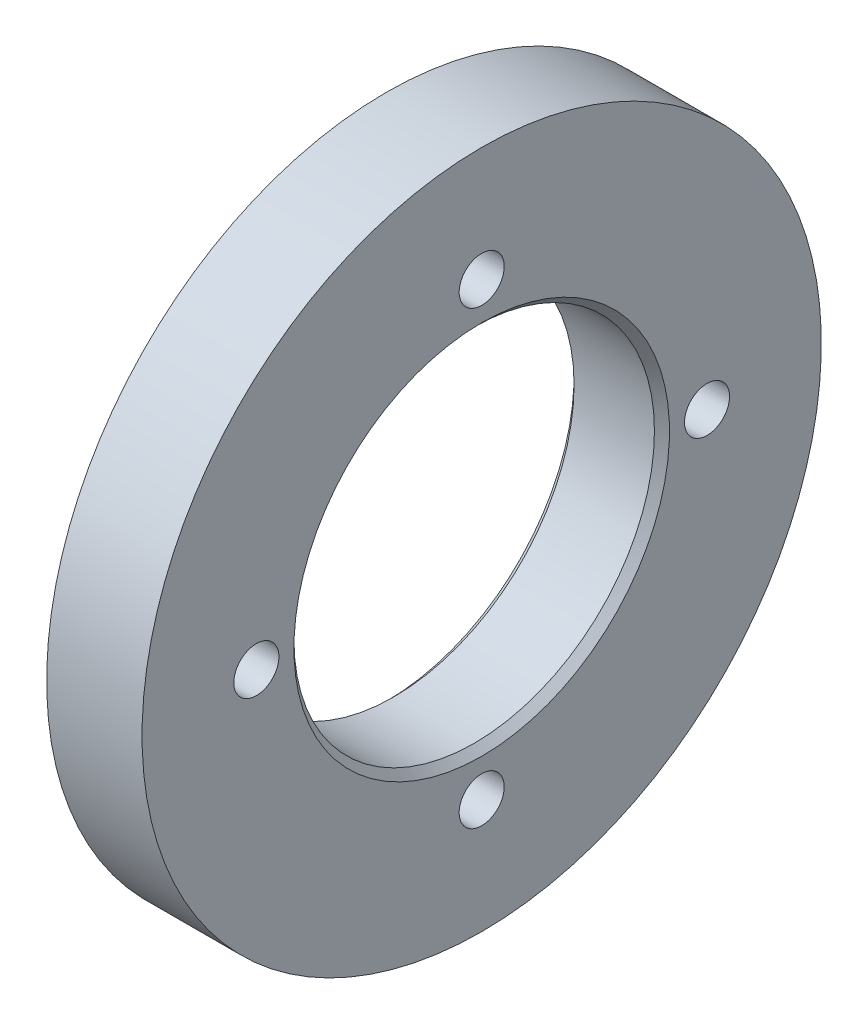
ISO-10303-21;
HEADER;
FILE_DESCRIPTION(('STEP AP214'),'2;1');
FILE_NAME('part.step','',(''),(''),'','','');
FILE_SCHEMA(('AUTOMOTIVE_DESIGN { 1 0 10303 214 1 1 1 1 }'));
ENDSEC;
DATA;
#1=APPLICATION_CONTEXT('core data for automotive mechanical design processes');
#2=APPLICATION_PROTOCOL_DEFINITION('international standard','automotive_design',2000,#1);
#3=PRODUCT_CONTEXT('',#1,'mechanical');
#4=PRODUCT('Part','Part','',(#3));
#5=PRODUCT_RELATED_PRODUCT_CATEGORY('part','',(#4));
#6=PRODUCT_DEFINITION_FORMATION('','',#4);
#7=PRODUCT_DEFINITION_CONTEXT('part definition',#1,'design');
#8=PRODUCT_DEFINITION('design','',#6,#7);
#9=PRODUCT_DEFINITION_SHAPE('','',#8);
#10=(LENGTH_UNIT() NAMED_UNIT(*) SI_UNIT(.MILLI.,.METRE.));
#11=(NAMED_UNIT(*) PLANE_ANGLE_UNIT() SI_UNIT($,.RADIAN.));
#12=(NAMED_UNIT(*) SI_UNIT($,.STERADIAN.) SOLID_ANGLE_UNIT());
#13=UNCERTAINTY_MEASURE_WITH_UNIT(LENGTH_MEASURE(1.E-05),#10,'distance_accuracy_value','');
#14=(GEOMETRIC_REPRESENTATION_CONTEXT(3) GLOBAL_UNCERTAINTY_ASSIGNED_CONTEXT((#13)) GLOBAL_UNIT_ASSIGNED_CONTEXT((#10,
#11,#12)) REPRESENTATION_CONTEXT('',''));
#15=CARTESIAN_POINT('',(0.,0.,0.));
#16=DIRECTION('',(0.,0.,1.));
#17=DIRECTION('',(1.,0.,0.));
#18=AXIS2_PLACEMENT_3D('',#15,#16,#17);
#19=CARTESIAN_POINT('',(6.34999999999764,0.,0.));
#20=DIRECTION('',(1.,0.,0.));
#21=DIRECTION('',(0.,1.,0.));
#22=AXIS2_PLACEMENT_3D('',#19,#20,#21);
#23=CONICAL_SURFACE('',#22,12.4999999999994,0.785398163396227);
#24=CARTESIAN_POINT('',(6.34999999999764,0.,0.));
#25=DIRECTION('',(1.,0.,0.));
#26=DIRECTION('',(0.,1.,0.));
#27=AXIS2_PLACEMENT_3D('',#24,#25,#26);
#28=CIRCLE('',#27,12.4999999999994);
#29=CARTESIAN_POINT('',(6.34999999999764,12.4999999999994,0.));
#30=VERTEX_POINT('',#29);
#31=EDGE_CURVE('E18',#30,#30,#28,.T.);
#32=ORIENTED_EDGE('',*,*,#31,.T.);
#33=EDGE_LOOP('',(#32));
#34=FACE_BOUND('',#33,.T.);
#35=CARTESIAN_POINT('',(5.84999999999703,0.,0.));
#36=DIRECTION('',(-1.,0.,0.));
#37=DIRECTION('',(0.,-1.,0.));
#38=AXIS2_PLACEMENT_3D('',#35,#36,#37);
#39=CIRCLE('',#38,12.);
#40=CARTESIAN_POINT('',(5.84999999999703,-12.,0.));
#41=VERTEX_POINT('',#40);
#42=EDGE_CURVE('E30',#41,#41,#39,.T.);
#43=ORIENTED_EDGE('',*,*,#42,.T.);
#44=EDGE_LOOP('',(#43));
#45=FACE_BOUND('',#44,.T.);
#46=ADVANCED_FACE('F15',(#34,#45),#23,.F.);
#47=CARTESIAN_POINT('',(-5.09999999999966,0.,0.));
#48=DIRECTION('',(-1.,0.,0.));
#49=DIRECTION('',(0.,-1.,0.));
#50=AXIS2_PLACEMENT_3D('',#47,#48,#49);
#51=CYLINDRICAL_SURFACE('',#50,12.);
#52=ORIENTED_EDGE('',*,*,#42,.F.);
#53=EDGE_LOOP('',(#52));
#54=FACE_BOUND('',#53,.T.);
#55=CARTESIAN_POINT('',(0.499999999999392,0.,0.));
#56=DIRECTION('',(-1.,0.,0.));
#57=DIRECTION('',(0.,-1.,0.));
#58=AXIS2_PLACEMENT_3D('',#55,#56,#57);
#59=CIRCLE('',#58,12.);
#60=CARTESIAN_POINT('',(0.499999999999394,-12.,0.));
#61=VERTEX_POINT('',#60);
#62=EDGE_CURVE('E47',#61,#61,#59,.T.);
#63=ORIENTED_EDGE('',*,*,#62,.T.);
#64=EDGE_LOOP('',(#63));
#65=FACE_BOUND('',#64,.T.);
#66=ADVANCED_FACE('F67',(#54,#65),#51,.F.);
#67=CARTESIAN_POINT('',(6.34999999999764,12.4999999999994,0.));
#68=DIRECTION('',(-1.,0.,0.));
#69=DIRECTION('',(0.,-1.,0.));
#70=AXIS2_PLACEMENT_3D('',#67,#68,#69);
#71=PLANE('',#70);
#72=CARTESIAN_POINT('',(6.34999999999764,-15.,0.));
#73=DIRECTION('',(1.,0.,0.));
#74=DIRECTION('',(0.,0.,-1.));
#75=AXIS2_PLACEMENT_3D('',#72,#73,#74);
#76=CIRCLE('',#75,1.49999999999999);
#77=CARTESIAN_POINT('',(6.34999999999764,-15.,-1.49999999999999));
#78=VERTEX_POINT('',#77);
#79=EDGE_CURVE('E54',#78,#78,#76,.F.);
#80=ORIENTED_EDGE('',*,*,#79,.T.);
#81=EDGE_LOOP('',(#80));
#82=FACE_BOUND('',#81,.T.);
#83=ORIENTED_EDGE('',*,*,#31,.F.);
#84=EDGE_LOOP('',(#83));
#85=FACE_BOUND('',#84,.T.);
#86=CARTESIAN_POINT('',(6.34999999999764,0.,0.));
#87=DIRECTION('',(-1.,0.,0.));
#88=DIRECTION('',(0.,-1.,0.));
#89=AXIS2_PLACEMENT_3D('',#86,#87,#88);
#90=CIRCLE('',#89,22.6095000000003);
#91=CARTESIAN_POINT('',(6.34999999999764,-22.6095000000003,0.));
#92=VERTEX_POINT('',#91);
#93=EDGE_CURVE('E44',#92,#92,#90,.T.);
#94=ORIENTED_EDGE('',*,*,#93,.F.);
#95=EDGE_LOOP('',(#94));
#96=FACE_BOUND('',#95,.T.);
#97=CARTESIAN_POINT('',(6.34999999999764,15.,0.));
#98=DIRECTION('',(1.,0.,0.));
#99=DIRECTION('',(0.,0.,-1.));
#100=AXIS2_PLACEMENT_3D('',#97,#98,#99);
#101=CIRCLE('',#100,1.49999999999999);
#102=CARTESIAN_POINT('',(6.34999999999764,15.,-1.49999999999999));
#103=VERTEX_POINT('',#102);
#104=EDGE_CURVE('E48',#103,#103,#101,.F.);
#105=ORIENTED_EDGE('',*,*,#104,.T.);
#106=EDGE_LOOP('',(#105));
#107=FACE_BOUND('',#106,.T.);
#108=CARTESIAN_POINT('',(6.34999999999764,0.,-15.));
#109=DIRECTION('',(1.,0.,0.));
#110=DIRECTION('',(0.,0.,-1.));
#111=AXIS2_PLACEMENT_3D('',#108,#109,#110);
#112=CIRCLE('',#111,1.49999999999999);
#113=CARTESIAN_POINT('',(6.34999999999764,0.,-16.5));
#114=VERTEX_POINT('',#113);
#115=EDGE_CURVE('E51',#114,#114,#112,.F.);
#116=ORIENTED_EDGE('',*,*,#115,.T.);
#117=EDGE_LOOP('',(#116));
#118=FACE_BOUND('',#117,.T.);
#119=CARTESIAN_POINT('',(6.34999999999764,1.57810790484045E-13,15.));
#120=DIRECTION('',(1.,0.,0.));
#121=DIRECTION('',(0.,0.,-1.));
#122=AXIS2_PLACEMENT_3D('',#119,#120,#121);
#123=CIRCLE('',#122,1.49999999999999);
#124=CARTESIAN_POINT('',(6.34999999999764,1.57810790484045E-13,13.5));
#125=VERTEX_POINT('',#124);
#126=EDGE_CURVE('E56',#125,#125,#123,.F.);
#127=ORIENTED_EDGE('',*,*,#126,.T.);
#128=EDGE_LOOP('',(#127));
#129=FACE_BOUND('',#128,.T.);
#130=ADVANCED_FACE('F70',(#82,#85,#96,#107,#118,#129),#71,.F.);
#131=CARTESIAN_POINT('',(6.34999999999764,1.57810790484045E-13,15.));
#132=DIRECTION('',(1.,0.,0.));
#133=DIRECTION('',(0.,0.,-1.));
#134=AXIS2_PLACEMENT_3D('',#131,#132,#133);
#135=CYLINDRICAL_SURFACE('',#134,1.49999999999999);
#136=CARTESIAN_POINT('',(0.,1.57810790484045E-13,15.));
#137=DIRECTION('',(1.,0.,0.));
#138=DIRECTION('',(0.,0.,-1.));
#139=AXIS2_PLACEMENT_3D('',#136,#137,#138);
#140=CIRCLE('',#139,1.49999999999999);
#141=CARTESIAN_POINT('',(0.,1.57810790484045E-13,13.5));
#142=VERTEX_POINT('',#141);
#143=EDGE_CURVE('E41',#142,#142,#140,.F.);
#144=ORIENTED_EDGE('',*,*,#143,.T.);
#145=EDGE_LOOP('',(#144));
#146=FACE_BOUND('',#145,.T.);
#147=ORIENTED_EDGE('',*,*,#126,.F.);
#148=EDGE_LOOP('',(#147));
#149=FACE_BOUND('',#148,.T.);
#150=ADVANCED_FACE('F95',(#146,#149),#135,.F.);
#151=CARTESIAN_POINT('',(6.34999999999764,-15.,0.));
#152=DIRECTION('',(1.,0.,0.));
#153=DIRECTION('',(0.,0.,-1.));
#154=AXIS2_PLACEMENT_3D('',#151,#152,#153);
#155=CYLINDRICAL_SURFACE('',#154,1.49999999999999);
#156=CARTESIAN_POINT('',(0.,-15.,0.));
#157=DIRECTION('',(1.,0.,0.));
#158=DIRECTION('',(0.,0.,-1.));
#159=AXIS2_PLACEMENT_3D('',#156,#157,#158);
#160=CIRCLE('',#159,1.49999999999999);
#161=CARTESIAN_POINT('',(0.,-15.,-1.49999999999999));
#162=VERTEX_POINT('',#161);
#163=EDGE_CURVE('E38',#162,#162,#160,.F.);
#164=ORIENTED_EDGE('',*,*,#163,.T.);
#165=EDGE_LOOP('',(#164));
#166=FACE_BOUND('',#165,.T.);
#167=ORIENTED_EDGE('',*,*,#79,.F.);
#168=EDGE_LOOP('',(#167));
#169=FACE_BOUND('',#168,.T.);
#170=ADVANCED_FACE('F98',(#166,#169),#155,.F.);
#171=CARTESIAN_POINT('',(6.34999999999764,0.,-15.));
#172=DIRECTION('',(1.,0.,0.));
#173=DIRECTION('',(0.,0.,-1.));
#174=AXIS2_PLACEMENT_3D('',#171,#172,#173);
#175=CYLINDRICAL_SURFACE('',#174,1.49999999999999);
#176=CARTESIAN_POINT('',(0.,0.,-15.));
#177=DIRECTION('',(1.,0.,0.));
#178=DIRECTION('',(0.,0.,-1.));
#179=AXIS2_PLACEMENT_3D('',#176,#177,#178);
#180=CIRCLE('',#179,1.49999999999999);
#181=CARTESIAN_POINT('',(0.,0.,-16.5));
#182=VERTEX_POINT('',#181);
#183=EDGE_CURVE('E35',#182,#182,#180,.F.);
#184=ORIENTED_EDGE('',*,*,#183,.T.);
#185=EDGE_LOOP('',(#184));
#186=FACE_BOUND('',#185,.T.);
#187=ORIENTED_EDGE('',*,*,#115,.F.);
#188=EDGE_LOOP('',(#187));
#189=FACE_BOUND('',#188,.T.);
#190=ADVANCED_FACE('F105',(#186,#189),#175,.F.);
#191=CARTESIAN_POINT('',(6.34999999999764,15.,0.));
#192=DIRECTION('',(1.,0.,0.));
#193=DIRECTION('',(0.,0.,-1.));
#194=AXIS2_PLACEMENT_3D('',#191,#192,#193);
#195=CYLINDRICAL_SURFACE('',#194,1.49999999999999);
#196=CARTESIAN_POINT('',(0.,15.,0.));
#197=DIRECTION('',(1.,0.,0.));
#198=DIRECTION('',(0.,0.,-1.));
#199=AXIS2_PLACEMENT_3D('',#196,#197,#198);
#200=CIRCLE('',#199,1.49999999999999);
#201=CARTESIAN_POINT('',(0.,15.,-1.49999999999999));
#202=VERTEX_POINT('',#201);
#203=EDGE_CURVE('E27',#202,#202,#200,.F.);
#204=ORIENTED_EDGE('',*,*,#203,.T.);
#205=EDGE_LOOP('',(#204));
#206=FACE_BOUND('',#205,.T.);
#207=ORIENTED_EDGE('',*,*,#104,.F.);
#208=EDGE_LOOP('',(#207));
#209=FACE_BOUND('',#208,.T.);
#210=ADVANCED_FACE('F78',(#206,#209),#195,.F.);
#211=CARTESIAN_POINT('',(0.,0.,0.));
#212=DIRECTION('',(-1.,0.,0.));
#213=DIRECTION('',(0.,-1.,0.));
#214=AXIS2_PLACEMENT_3D('',#211,#212,#213);
#215=CONICAL_SURFACE('',#214,12.4999999999994,0.785398163397446);
#216=ORIENTED_EDGE('',*,*,#62,.F.);
#217=EDGE_LOOP('',(#216));
#218=FACE_BOUND('',#217,.T.);
#219=CARTESIAN_POINT('',(0.,0.,0.));
#220=DIRECTION('',(-1.,0.,0.));
#221=DIRECTION('',(0.,-1.,0.));
#222=AXIS2_PLACEMENT_3D('',#219,#220,#221);
#223=CIRCLE('',#222,12.4999999999994);
#224=CARTESIAN_POINT('',(0.,-12.4999999999994,0.));
#225=VERTEX_POINT('',#224);
#226=EDGE_CURVE('E22',#225,#225,#223,.T.);
#227=ORIENTED_EDGE('',*,*,#226,.T.);
#228=EDGE_LOOP('',(#227));
#229=FACE_BOUND('',#228,.T.);
#230=ADVANCED_FACE('F74',(#218,#229),#215,.F.);
#231=CARTESIAN_POINT('',(-5.09999999999966,0.,0.));
#232=DIRECTION('',(-1.,0.,0.));
#233=DIRECTION('',(0.,-1.,0.));
#234=AXIS2_PLACEMENT_3D('',#231,#232,#233);
#235=CYLINDRICAL_SURFACE('',#234,22.6095000000003);
#236=CARTESIAN_POINT('',(0.,0.,0.));
#237=DIRECTION('',(-1.,0.,0.));
#238=DIRECTION('',(0.,-1.,0.));
#239=AXIS2_PLACEMENT_3D('',#236,#237,#238);
#240=CIRCLE('',#239,22.6095000000003);
#241=CARTESIAN_POINT('',(0.,-22.6095000000003,0.));
#242=VERTEX_POINT('',#241);
#243=EDGE_CURVE('E10',#242,#242,#240,.F.);
#244=ORIENTED_EDGE('',*,*,#243,.T.);
#245=EDGE_LOOP('',(#244));
#246=FACE_BOUND('',#245,.T.);
#247=ORIENTED_EDGE('',*,*,#93,.T.);
#248=EDGE_LOOP('',(#247));
#249=FACE_BOUND('',#248,.T.);
#250=ADVANCED_FACE('F77',(#246,#249),#235,.T.);
#251=CARTESIAN_POINT('',(0.,22.6095000000003,0.));
#252=DIRECTION('',(1.,0.,0.));
#253=DIRECTION('',(0.,1.,0.));
#254=AXIS2_PLACEMENT_3D('',#251,#252,#253);
#255=PLANE('',#254);
#256=ORIENTED_EDGE('',*,*,#243,.F.);
#257=EDGE_LOOP('',(#256));
#258=FACE_BOUND('',#257,.T.);
#259=ORIENTED_EDGE('',*,*,#226,.F.);
#260=EDGE_LOOP('',(#259));
#261=FACE_BOUND('',#260,.T.);
#262=ORIENTED_EDGE('',*,*,#203,.F.);
#263=EDGE_LOOP('',(#262));
#264=FACE_BOUND('',#263,.T.);
#265=ORIENTED_EDGE('',*,*,#183,.F.);
#266=EDGE_LOOP('',(#265));
#267=FACE_BOUND('',#266,.T.);
#268=ORIENTED_EDGE('',*,*,#163,.F.);
#269=EDGE_LOOP('',(#268));
#270=FACE_BOUND('',#269,.T.);
#271=ORIENTED_EDGE('',*,*,#143,.F.);
#272=EDGE_LOOP('',(#271));
#273=FACE_BOUND('',#272,.T.);
#274=ADVANCED_FACE('F82',(#258,#261,#264,#267,#270,#273),#255,.F.);
#275=CLOSED_SHELL('',(#46,#66,#130,#150,#170,#190,#210,#230,#250,#274));
#276=MANIFOLD_SOLID_BREP('B1',#275);
#277=ADVANCED_BREP_SHAPE_REPRESENTATION('',(#18,#276),#14);
#278=SHAPE_DEFINITION_REPRESENTATION(#9,#277);
ENDSEC;
END-ISO-10303-21;
